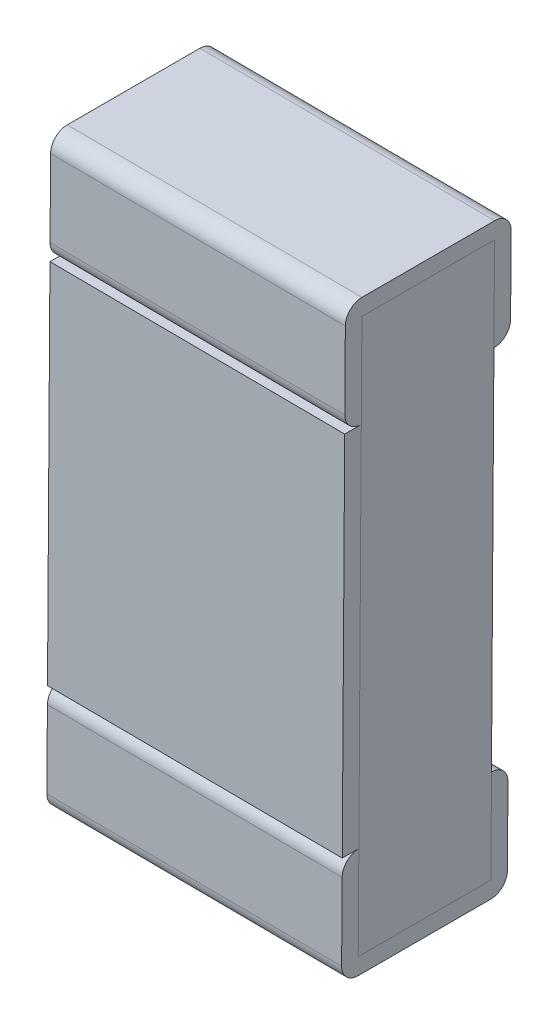
ISO-10303-21;
HEADER;
FILE_DESCRIPTION(('STEP AP214'),'2;1');
FILE_NAME('part.step','',(''),(''),'','','');
FILE_SCHEMA(('AUTOMOTIVE_DESIGN { 1 0 10303 214 1 1 1 1 }'));
ENDSEC;
DATA;
#1=APPLICATION_CONTEXT('core data for automotive mechanical design processes');
#2=APPLICATION_PROTOCOL_DEFINITION('international standard','automotive_design',2000,#1);
#3=PRODUCT_CONTEXT('',#1,'mechanical');
#4=PRODUCT('Part','Part','',(#3));
#5=PRODUCT_RELATED_PRODUCT_CATEGORY('part','',(#4));
#6=PRODUCT_DEFINITION_FORMATION('','',#4);
#7=PRODUCT_DEFINITION_CONTEXT('part definition',#1,'design');
#8=PRODUCT_DEFINITION('design','',#6,#7);
#9=PRODUCT_DEFINITION_SHAPE('','',#8);
#10=(LENGTH_UNIT() NAMED_UNIT(*) SI_UNIT(.MILLI.,.METRE.));
#11=(NAMED_UNIT(*) PLANE_ANGLE_UNIT() SI_UNIT($,.RADIAN.));
#12=(NAMED_UNIT(*) SI_UNIT($,.STERADIAN.) SOLID_ANGLE_UNIT());
#13=UNCERTAINTY_MEASURE_WITH_UNIT(LENGTH_MEASURE(1.E-05),#10,'distance_accuracy_value','');
#14=(GEOMETRIC_REPRESENTATION_CONTEXT(3) GLOBAL_UNCERTAINTY_ASSIGNED_CONTEXT((#13)) GLOBAL_UNIT_ASSIGNED_CONTEXT((#10,
#11,#12)) REPRESENTATION_CONTEXT('',''));
#15=CARTESIAN_POINT('',(0.,0.,0.));
#16=DIRECTION('',(0.,0.,1.));
#17=DIRECTION('',(1.,0.,0.));
#18=AXIS2_PLACEMENT_3D('',#15,#16,#17);
#19=CARTESIAN_POINT('',(216.723566327563,106.259604065582,142.661582908599));
#20=DIRECTION('',(0.,0.,1.));
#21=DIRECTION('',(1.,0.,0.));
#22=AXIS2_PLACEMENT_3D('',#19,#20,#21);
#23=PLANE('',#22);
#24=DIRECTION('',(0.999978016708569,-0.00663069374923689,0.));
#25=VECTOR('',#24,1.);
#26=CARTESIAN_POINT('',(216.723566327563,106.259604065582,142.661582908599));
#27=LINE('',#26,#25);
#28=CARTESIAN_POINT('',(216.723566327563,106.259604065582,142.661582908599));
#29=VERTEX_POINT('',#28);
#30=CARTESIAN_POINT('',(217.52354874093,106.254299510583,142.661582908599));
#31=VERTEX_POINT('',#30);
#32=EDGE_CURVE('E67',#29,#31,#27,.T.);
#33=ORIENTED_EDGE('',*,*,#32,.F.);
#34=DIRECTION('',(-0.00663069374923689,-0.999978016708569,0.));
#35=VECTOR('',#34,1.);
#36=CARTESIAN_POINT('',(216.723566327563,106.259604065582,142.661582908599));
#37=LINE('',#36,#35);
#38=CARTESIAN_POINT('',(216.716935633814,105.259626048874,142.661582908599));
#39=VERTEX_POINT('',#38);
#40=EDGE_CURVE('E11',#29,#39,#37,.T.);
#41=ORIENTED_EDGE('',*,*,#40,.T.);
#42=DIRECTION('',(0.999978016708569,-0.00663069374923689,0.));
#43=VECTOR('',#42,1.);
#44=CARTESIAN_POINT('',(216.716935633814,105.259626048874,142.661582908599));
#45=LINE('',#44,#43);
#46=CARTESIAN_POINT('',(217.516918047181,105.254321493874,142.661582908599));
#47=VERTEX_POINT('',#46);
#48=EDGE_CURVE('E55',#39,#47,#45,.T.);
#49=ORIENTED_EDGE('',*,*,#48,.T.);
#50=DIRECTION('',(-0.00663069374923689,-0.999978016708569,0.));
#51=VECTOR('',#50,1.);
#52=CARTESIAN_POINT('',(217.52354874093,106.254299510583,142.661582908599));
#53=LINE('',#52,#51);
#54=EDGE_CURVE('E313',#31,#47,#53,.T.);
#55=ORIENTED_EDGE('',*,*,#54,.F.);
#56=EDGE_LOOP('',(#33,#41,#49,#55));
#57=FACE_BOUND('',#56,.T.);
#58=ADVANCED_FACE('F44',(#57),#23,.T.);
#59=CARTESIAN_POINT('',(216.716935633814,105.259626048874,142.616582908599));
#60=DIRECTION('',(-0.00663069374923689,-0.99997801670857,0.));
#61=DIRECTION('',(-0.99997801670857,0.00663069374923689,0.));
#62=AXIS2_PLACEMENT_3D('',#59,#60,#61);
#63=PLANE('',#62);
#64=DIRECTION('',(0.,0.,1.));
#65=VECTOR('',#64,1.);
#66=CARTESIAN_POINT('',(216.716935633814,105.259626048874,142.616582908599));
#67=LINE('',#66,#65);
#68=CARTESIAN_POINT('',(216.716935633814,105.259626048874,142.616582908599));
#69=VERTEX_POINT('',#68);
#70=EDGE_CURVE('E326',#69,#39,#67,.T.);
#71=ORIENTED_EDGE('',*,*,#70,.F.);
#72=DIRECTION('',(0.999978016708569,-0.00663069374923689,0.));
#73=VECTOR('',#72,1.);
#74=CARTESIAN_POINT('',(216.716935633814,105.259626048874,142.616582908599));
#75=LINE('',#74,#73);
#76=CARTESIAN_POINT('',(217.516918047181,105.254321493874,142.616582908599));
#77=VERTEX_POINT('',#76);
#78=EDGE_CURVE('E302',#69,#77,#75,.T.);
#79=ORIENTED_EDGE('',*,*,#78,.T.);
#80=DIRECTION('',(0.,0.,1.));
#81=VECTOR('',#80,1.);
#82=CARTESIAN_POINT('',(217.516918047181,105.254321493874,142.616582908599));
#83=LINE('',#82,#81);
#84=EDGE_CURVE('E298',#77,#47,#83,.T.);
#85=ORIENTED_EDGE('',*,*,#84,.T.);
#86=ORIENTED_EDGE('',*,*,#48,.F.);
#87=EDGE_LOOP('',(#71,#79,#85,#86));
#88=FACE_BOUND('',#87,.T.);
#89=ADVANCED_FACE('F523',(#88),#63,.T.);
#90=CARTESIAN_POINT('',(216.716637252595,105.214627038122,142.616582908599));
#91=DIRECTION('',(0.999978016708571,-0.00663069374900344,0.));
#92=DIRECTION('',(0.00663069374900344,0.999978016708571,0.));
#93=AXIS2_PLACEMENT_3D('',#90,#91,#92);
#94=CYLINDRICAL_SURFACE('',#93,0.0450000000000037);
#95=CARTESIAN_POINT('',(216.716637252595,105.214627038122,142.616582908599));
#96=DIRECTION('',(0.99997801670857,-0.00663069374923689,0.));
#97=DIRECTION('',(0.,0.,1.));
#98=AXIS2_PLACEMENT_3D('',#95,#96,#97);
#99=CIRCLE('',#98,0.0449999999999895);
#100=CARTESIAN_POINT('',(216.716637252595,105.214627038122,142.661582908599));
#101=VERTEX_POINT('',#100);
#102=EDGE_CURVE('E303',#69,#101,#99,.T.);
#103=ORIENTED_EDGE('',*,*,#102,.T.);
#104=DIRECTION('',(0.999978016708569,-0.00663069374923689,0.));
#105=VECTOR('',#104,1.);
#106=CARTESIAN_POINT('',(216.716637252595,105.214627038122,142.661582908599));
#107=LINE('',#106,#105);
#108=CARTESIAN_POINT('',(217.516619665962,105.209322483122,142.661582908599));
#109=VERTEX_POINT('',#108);
#110=EDGE_CURVE('E345',#101,#109,#107,.T.);
#111=ORIENTED_EDGE('',*,*,#110,.T.);
#112=CARTESIAN_POINT('',(217.516619665962,105.209322483122,142.616582908599));
#113=DIRECTION('',(0.99997801670857,-0.00663069374923689,0.));
#114=DIRECTION('',(0.,0.,1.));
#115=AXIS2_PLACEMENT_3D('',#112,#113,#114);
#116=CIRCLE('',#115,0.0449999999999895);
#117=EDGE_CURVE('E387',#77,#109,#116,.T.);
#118=ORIENTED_EDGE('',*,*,#117,.F.);
#119=ORIENTED_EDGE('',*,*,#78,.F.);
#120=EDGE_LOOP('',(#103,#111,#118,#119));
#121=FACE_BOUND('',#120,.T.);
#122=ADVANCED_FACE('F528',(#121),#94,.T.);
#123=CARTESIAN_POINT('',(216.716935633814,105.259626048874,142.661582908599));
#124=DIRECTION('',(0.,0.,1.));
#125=DIRECTION('',(1.,0.,0.));
#126=AXIS2_PLACEMENT_3D('',#123,#124,#125);
#127=PLANE('',#126);
#128=DIRECTION('',(-0.00663069374923689,-0.999978016708569,0.));
#129=VECTOR('',#128,1.);
#130=CARTESIAN_POINT('',(217.516918047181,105.254321493874,142.661582908599));
#131=LINE('',#130,#129);
#132=CARTESIAN_POINT('',(217.515227220275,104.999327099614,142.661582908599));
#133=VERTEX_POINT('',#132);
#134=EDGE_CURVE('E207',#109,#133,#131,.T.);
#135=ORIENTED_EDGE('',*,*,#134,.F.);
#136=ORIENTED_EDGE('',*,*,#110,.F.);
#137=DIRECTION('',(-0.00663069374923689,-0.999978016708569,0.));
#138=VECTOR('',#137,1.);
#139=CARTESIAN_POINT('',(216.716935633814,105.259626048874,142.661582908599));
#140=LINE('',#139,#138);
#141=CARTESIAN_POINT('',(216.715244806908,105.004631654613,142.661582908599));
#142=VERTEX_POINT('',#141);
#143=EDGE_CURVE('E355',#101,#142,#140,.T.);
#144=ORIENTED_EDGE('',*,*,#143,.T.);
#145=DIRECTION('',(0.999978016708569,-0.00663069374923689,0.));
#146=VECTOR('',#145,1.);
#147=CARTESIAN_POINT('',(216.715244806908,105.004631654613,142.661582908599));
#148=LINE('',#147,#146);
#149=EDGE_CURVE('E405',#142,#133,#148,.T.);
#150=ORIENTED_EDGE('',*,*,#149,.T.);
#151=EDGE_LOOP('',(#135,#136,#144,#150));
#152=FACE_BOUND('',#151,.T.);
#153=ADVANCED_FACE('F542',(#152),#127,.T.);
#154=CARTESIAN_POINT('',(216.715244806908,105.004631654613,142.616582908599));
#155=DIRECTION('',(0.999978016708571,-0.00663069374900344,0.));
#156=DIRECTION('',(-0.00663069374900344,-0.999978016708571,0.));
#157=AXIS2_PLACEMENT_3D('',#154,#155,#156);
#158=CYLINDRICAL_SURFACE('',#157,0.0450000000000037);
#159=DIRECTION('',(0.999978016708569,-0.00663069374923689,0.));
#160=VECTOR('',#159,1.);
#161=CARTESIAN_POINT('',(216.714946425689,104.959632643861,142.616582908599));
#162=LINE('',#161,#160);
#163=CARTESIAN_POINT('',(216.714946425689,104.959632643861,142.616582908599));
#164=VERTEX_POINT('',#163);
#165=CARTESIAN_POINT('',(217.514928839056,104.954328088862,142.616582908599));
#166=VERTEX_POINT('',#165);
#167=EDGE_CURVE('E358',#164,#166,#162,.T.);
#168=ORIENTED_EDGE('',*,*,#167,.T.);
#169=CARTESIAN_POINT('',(217.515227220275,104.999327099614,142.616582908599));
#170=DIRECTION('',(-0.99997801670857,0.00663069374923689,0.));
#171=DIRECTION('',(0.,0.,1.));
#172=AXIS2_PLACEMENT_3D('',#169,#170,#171);
#173=CIRCLE('',#172,0.0449999999999895);
#174=EDGE_CURVE('E200',#166,#133,#173,.T.);
#175=ORIENTED_EDGE('',*,*,#174,.T.);
#176=ORIENTED_EDGE('',*,*,#149,.F.);
#177=CARTESIAN_POINT('',(216.715244806908,105.004631654613,142.616582908599));
#178=DIRECTION('',(-0.99997801670857,0.00663069374923689,0.));
#179=DIRECTION('',(0.,0.,1.));
#180=AXIS2_PLACEMENT_3D('',#177,#178,#179);
#181=CIRCLE('',#180,0.0449999999999895);
#182=EDGE_CURVE('E192',#164,#142,#181,.T.);
#183=ORIENTED_EDGE('',*,*,#182,.F.);
#184=EDGE_LOOP('',(#168,#175,#176,#183));
#185=FACE_BOUND('',#184,.T.);
#186=ADVANCED_FACE('F539',(#185),#158,.T.);
#187=CARTESIAN_POINT('',(216.714946425689,104.959632643861,142.211582908599));
#188=DIRECTION('',(-0.00663069374923689,-0.99997801670857,0.));
#189=DIRECTION('',(-0.99997801670857,0.00663069374923689,0.));
#190=AXIS2_PLACEMENT_3D('',#187,#188,#189);
#191=PLANE('',#190);
#192=DIRECTION('',(0.,0.,1.));
#193=VECTOR('',#192,1.);
#194=CARTESIAN_POINT('',(216.714946425689,104.959632643861,142.211582908599));
#195=LINE('',#194,#193);
#196=CARTESIAN_POINT('',(216.714946425689,104.959632643861,142.256582908599));
#197=VERTEX_POINT('',#196);
#198=EDGE_CURVE('E471',#197,#164,#195,.T.);
#199=ORIENTED_EDGE('',*,*,#198,.F.);
#200=DIRECTION('',(0.999978016708569,-0.00663069374923689,0.));
#201=VECTOR('',#200,1.);
#202=CARTESIAN_POINT('',(216.714946425689,104.959632643861,142.256582908599));
#203=LINE('',#202,#201);
#204=CARTESIAN_POINT('',(217.514928839056,104.954328088862,142.256582908599));
#205=VERTEX_POINT('',#204);
#206=EDGE_CURVE('E318',#197,#205,#203,.T.);
#207=ORIENTED_EDGE('',*,*,#206,.T.);
#208=DIRECTION('',(0.,0.,1.));
#209=VECTOR('',#208,1.);
#210=CARTESIAN_POINT('',(217.514928839056,104.954328088862,142.211582908599));
#211=LINE('',#210,#209);
#212=EDGE_CURVE('E314',#205,#166,#211,.T.);
#213=ORIENTED_EDGE('',*,*,#212,.T.);
#214=ORIENTED_EDGE('',*,*,#167,.F.);
#215=EDGE_LOOP('',(#199,#207,#213,#214));
#216=FACE_BOUND('',#215,.T.);
#217=ADVANCED_FACE('F532',(#216),#191,.T.);
#218=CARTESIAN_POINT('',(216.715244806908,105.004631654613,142.256582908599));
#219=DIRECTION('',(0.999978016708571,-0.00663069374900344,0.));
#220=DIRECTION('',(-0.00663069374900344,-0.999978016708571,0.));
#221=AXIS2_PLACEMENT_3D('',#218,#219,#220);
#222=CYLINDRICAL_SURFACE('',#221,0.0450000000000037);
#223=CARTESIAN_POINT('',(216.715244806908,105.004631654613,142.256582908599));
#224=DIRECTION('',(0.99997801670857,-0.00663069374923689,0.));
#225=DIRECTION('',(0.,0.,1.));
#226=AXIS2_PLACEMENT_3D('',#223,#224,#225);
#227=CIRCLE('',#226,0.0449999999999895);
#228=CARTESIAN_POINT('',(216.715244806908,105.004631654613,142.211582908599));
#229=VERTEX_POINT('',#228);
#230=EDGE_CURVE('E319',#197,#229,#227,.T.);
#231=ORIENTED_EDGE('',*,*,#230,.T.);
#232=DIRECTION('',(0.999978016708569,-0.00663069374923689,0.));
#233=VECTOR('',#232,1.);
#234=CARTESIAN_POINT('',(216.715244806908,105.004631654613,142.211582908599));
#235=LINE('',#234,#233);
#236=CARTESIAN_POINT('',(217.515227220275,104.999327099614,142.211582908599));
#237=VERTEX_POINT('',#236);
#238=EDGE_CURVE('E409',#229,#237,#235,.T.);
#239=ORIENTED_EDGE('',*,*,#238,.T.);
#240=CARTESIAN_POINT('',(217.515227220275,104.999327099614,142.256582908599));
#241=DIRECTION('',(0.99997801670857,-0.00663069374923689,0.));
#242=DIRECTION('',(0.,0.,1.));
#243=AXIS2_PLACEMENT_3D('',#240,#241,#242);
#244=CIRCLE('',#243,0.0449999999999895);
#245=EDGE_CURVE('E346',#205,#237,#244,.T.);
#246=ORIENTED_EDGE('',*,*,#245,.F.);
#247=ORIENTED_EDGE('',*,*,#206,.F.);
#248=EDGE_LOOP('',(#231,#239,#246,#247));
#249=FACE_BOUND('',#248,.T.);
#250=ADVANCED_FACE('F676',(#249),#222,.T.);
#251=CARTESIAN_POINT('',(216.716935633814,105.259626048874,142.211582908599));
#252=DIRECTION('',(0.,0.,1.));
#253=DIRECTION('',(1.,0.,0.));
#254=AXIS2_PLACEMENT_3D('',#251,#252,#253);
#255=PLANE('',#254);
#256=ORIENTED_EDGE('',*,*,#238,.F.);
#257=DIRECTION('',(-0.00663069374923689,-0.999978016708569,0.));
#258=VECTOR('',#257,1.);
#259=CARTESIAN_POINT('',(216.716935633814,105.259626048874,142.211582908599));
#260=LINE('',#259,#258);
#261=CARTESIAN_POINT('',(216.716637252595,105.214627038122,142.211582908599));
#262=VERTEX_POINT('',#261);
#263=EDGE_CURVE('E416',#262,#229,#260,.T.);
#264=ORIENTED_EDGE('',*,*,#263,.F.);
#265=DIRECTION('',(0.999978016708569,-0.00663069374923689,0.));
#266=VECTOR('',#265,1.);
#267=CARTESIAN_POINT('',(216.716637252595,105.214627038122,142.211582908599));
#268=LINE('',#267,#266);
#269=CARTESIAN_POINT('',(217.516619665962,105.209322483122,142.211582908599));
#270=VERTEX_POINT('',#269);
#271=EDGE_CURVE('E363',#262,#270,#268,.T.);
#272=ORIENTED_EDGE('',*,*,#271,.T.);
#273=DIRECTION('',(-0.00663069374923689,-0.999978016708569,0.));
#274=VECTOR('',#273,1.);
#275=CARTESIAN_POINT('',(217.516918047181,105.254321493874,142.211582908599));
#276=LINE('',#275,#274);
#277=EDGE_CURVE('E359',#270,#237,#276,.T.);
#278=ORIENTED_EDGE('',*,*,#277,.T.);
#279=EDGE_LOOP('',(#256,#264,#272,#278));
#280=FACE_BOUND('',#279,.T.);
#281=ADVANCED_FACE('F699',(#280),#255,.F.);
#282=CARTESIAN_POINT('',(216.716637252595,105.214627038122,142.256582908599));
#283=DIRECTION('',(0.999978016708571,-0.00663069374900344,0.));
#284=DIRECTION('',(0.00663069374900344,0.999978016708571,0.));
#285=AXIS2_PLACEMENT_3D('',#282,#283,#284);
#286=CYLINDRICAL_SURFACE('',#285,0.0450000000000037);
#287=DIRECTION('',(0.999978016708569,-0.00663069374923689,0.));
#288=VECTOR('',#287,1.);
#289=CARTESIAN_POINT('',(216.716935633814,105.259626048874,142.256582908599));
#290=LINE('',#289,#288);
#291=CARTESIAN_POINT('',(216.716935633814,105.259626048874,142.256582908599));
#292=VERTEX_POINT('',#291);
#293=CARTESIAN_POINT('',(217.516918047181,105.254321493874,142.256582908599));
#294=VERTEX_POINT('',#293);
#295=EDGE_CURVE('E364',#292,#294,#290,.T.);
#296=ORIENTED_EDGE('',*,*,#295,.T.);
#297=CARTESIAN_POINT('',(217.516619665962,105.209322483122,142.256582908599));
#298=DIRECTION('',(-0.99997801670857,0.00663069374923689,0.));
#299=DIRECTION('',(0.,0.,1.));
#300=AXIS2_PLACEMENT_3D('',#297,#298,#299);
#301=CIRCLE('',#300,0.0449999999999895);
#302=EDGE_CURVE('E388',#294,#270,#301,.T.);
#303=ORIENTED_EDGE('',*,*,#302,.T.);
#304=ORIENTED_EDGE('',*,*,#271,.F.);
#305=CARTESIAN_POINT('',(216.716637252595,105.214627038122,142.256582908599));
#306=DIRECTION('',(-0.99997801670857,0.00663069374923689,0.));
#307=DIRECTION('',(0.,0.,1.));
#308=AXIS2_PLACEMENT_3D('',#305,#306,#307);
#309=CIRCLE('',#308,0.0449999999999895);
#310=EDGE_CURVE('E396',#292,#262,#309,.T.);
#311=ORIENTED_EDGE('',*,*,#310,.F.);
#312=EDGE_LOOP('',(#296,#303,#304,#311));
#313=FACE_BOUND('',#312,.T.);
#314=ADVANCED_FACE('F537',(#313),#286,.T.);
#315=CARTESIAN_POINT('',(217.52354874093,106.254299510583,142.616582908599));
#316=DIRECTION('',(0.99997801670857,-0.00663069374923689,0.));
#317=DIRECTION('',(0.,0.,-1.));
#318=AXIS2_PLACEMENT_3D('',#315,#316,#317);
#319=PLANE('',#318);
#320=DIRECTION('',(-0.00663069374923689,-0.999978016708569,0.));
#321=VECTOR('',#320,1.);
#322=CARTESIAN_POINT('',(217.52354874093,106.254299510583,142.616582908599));
#323=LINE('',#322,#321);
#324=CARTESIAN_POINT('',(217.52354874093,106.254299510583,142.616582908599));
#325=VERTEX_POINT('',#324);
#326=EDGE_CURVE('E332',#325,#77,#323,.T.);
#327=ORIENTED_EDGE('',*,*,#326,.F.);
#328=DIRECTION('',(0.,0.,1.));
#329=VECTOR('',#328,1.);
#330=CARTESIAN_POINT('',(217.52354874093,106.254299510583,142.616582908599));
#331=LINE('',#330,#329);
#332=EDGE_CURVE('E392',#325,#31,#331,.T.);
#333=ORIENTED_EDGE('',*,*,#332,.T.);
#334=ORIENTED_EDGE('',*,*,#54,.T.);
#335=ORIENTED_EDGE('',*,*,#84,.F.);
#336=EDGE_LOOP('',(#327,#333,#334,#335));
#337=FACE_BOUND('',#336,.T.);
#338=ADVANCED_FACE('F533',(#337),#319,.T.);
#339=CARTESIAN_POINT('',(217.516918047181,105.254321493874,142.211582908599));
#340=DIRECTION('',(0.99997801670857,-0.00663069374923689,0.));
#341=DIRECTION('',(0.,0.,-1.));
#342=AXIS2_PLACEMENT_3D('',#339,#340,#341);
#343=PLANE('',#342);
#344=ORIENTED_EDGE('',*,*,#277,.F.);
#345=ORIENTED_EDGE('',*,*,#302,.F.);
#346=DIRECTION('',(-0.00663069374923689,-0.999978016708569,0.));
#347=VECTOR('',#346,1.);
#348=CARTESIAN_POINT('',(217.525239567836,106.509293904844,142.256582908599));
#349=LINE('',#348,#347);
#350=CARTESIAN_POINT('',(217.515227220275,104.999327099614,142.256582908599));
#351=VERTEX_POINT('',#350);
#352=EDGE_CURVE('E310',#294,#351,#349,.T.);
#353=ORIENTED_EDGE('',*,*,#352,.T.);
#354=DIRECTION('',(0.,0.,1.));
#355=VECTOR('',#354,1.);
#356=CARTESIAN_POINT('',(217.515227220275,104.999327099614,142.256582908599));
#357=LINE('',#356,#355);
#358=CARTESIAN_POINT('',(217.515227220275,104.999327099614,142.616582908599));
#359=VERTEX_POINT('',#358);
#360=EDGE_CURVE('E48',#351,#359,#357,.T.);
#361=ORIENTED_EDGE('',*,*,#360,.T.);
#362=DIRECTION('',(-0.00663069374923689,-0.999978016708569,0.));
#363=VECTOR('',#362,1.);
#364=CARTESIAN_POINT('',(217.525239567836,106.509293904844,142.616582908599));
#365=LINE('',#364,#363);
#366=EDGE_CURVE('E336',#77,#359,#365,.T.);
#367=ORIENTED_EDGE('',*,*,#366,.F.);
#368=ORIENTED_EDGE('',*,*,#117,.T.);
#369=ORIENTED_EDGE('',*,*,#134,.T.);
#370=ORIENTED_EDGE('',*,*,#174,.F.);
#371=ORIENTED_EDGE('',*,*,#212,.F.);
#372=ORIENTED_EDGE('',*,*,#245,.T.);
#373=EDGE_LOOP('',(#344,#345,#353,#361,#367,#368,#369,#370,#371,#372));
#374=FACE_BOUND('',#373,.T.);
#375=ADVANCED_FACE('F536',(#374),#343,.T.);
#376=CARTESIAN_POINT('',(216.723566327563,106.259604065582,142.616582908599));
#377=DIRECTION('',(-0.00663069374923689,-0.99997801670857,0.));
#378=DIRECTION('',(-0.99997801670857,0.00663069374923689,0.));
#379=AXIS2_PLACEMENT_3D('',#376,#377,#378);
#380=PLANE('',#379);
#381=ORIENTED_EDGE('',*,*,#32,.T.);
#382=ORIENTED_EDGE('',*,*,#332,.F.);
#383=DIRECTION('',(0.999978016708569,-0.00663069374923689,0.));
#384=VECTOR('',#383,1.);
#385=CARTESIAN_POINT('',(216.723566327563,106.259604065582,142.616582908599));
#386=LINE('',#385,#384);
#387=CARTESIAN_POINT('',(216.723566327563,106.259604065582,142.616582908599));
#388=VERTEX_POINT('',#387);
#389=EDGE_CURVE('E369',#388,#325,#386,.T.);
#390=ORIENTED_EDGE('',*,*,#389,.F.);
#391=DIRECTION('',(0.,0.,1.));
#392=VECTOR('',#391,1.);
#393=CARTESIAN_POINT('',(216.723566327563,106.259604065582,142.616582908599));
#394=LINE('',#393,#392);
#395=EDGE_CURVE('E330',#388,#29,#394,.T.);
#396=ORIENTED_EDGE('',*,*,#395,.T.);
#397=EDGE_LOOP('',(#381,#382,#390,#396));
#398=FACE_BOUND('',#397,.T.);
#399=ADVANCED_FACE('F551',(#398),#380,.F.);
#400=CARTESIAN_POINT('',(216.723566327563,106.259604065582,142.616582908599));
#401=DIRECTION('',(0.99997801670857,-0.00663069374923689,0.));
#402=DIRECTION('',(0.,0.,-1.));
#403=AXIS2_PLACEMENT_3D('',#400,#401,#402);
#404=PLANE('',#403);
#405=ORIENTED_EDGE('',*,*,#70,.T.);
#406=ORIENTED_EDGE('',*,*,#40,.F.);
#407=ORIENTED_EDGE('',*,*,#395,.F.);
#408=DIRECTION('',(-0.00663069374923689,-0.999978016708569,0.));
#409=VECTOR('',#408,1.);
#410=CARTESIAN_POINT('',(216.723566327563,106.259604065582,142.616582908599));
#411=LINE('',#410,#409);
#412=EDGE_CURVE('E331',#388,#69,#411,.T.);
#413=ORIENTED_EDGE('',*,*,#412,.T.);
#414=EDGE_LOOP('',(#405,#406,#407,#413));
#415=FACE_BOUND('',#414,.T.);
#416=ADVANCED_FACE('F553',(#415),#404,.F.);
#417=CARTESIAN_POINT('',(216.716935633814,105.259626048874,142.211582908599));
#418=DIRECTION('',(0.99997801670857,-0.00663069374923689,0.));
#419=DIRECTION('',(0.,0.,-1.));
#420=AXIS2_PLACEMENT_3D('',#417,#418,#419);
#421=PLANE('',#420);
#422=ORIENTED_EDGE('',*,*,#230,.F.);
#423=ORIENTED_EDGE('',*,*,#198,.T.);
#424=ORIENTED_EDGE('',*,*,#182,.T.);
#425=ORIENTED_EDGE('',*,*,#143,.F.);
#426=ORIENTED_EDGE('',*,*,#102,.F.);
#427=DIRECTION('',(-0.00663069374923689,-0.999978016708569,0.));
#428=VECTOR('',#427,1.);
#429=CARTESIAN_POINT('',(216.725257154469,106.514598459843,142.616582908599));
#430=LINE('',#429,#428);
#431=CARTESIAN_POINT('',(216.715244806908,105.004631654613,142.616582908599));
#432=VERTEX_POINT('',#431);
#433=EDGE_CURVE('E393',#69,#432,#430,.T.);
#434=ORIENTED_EDGE('',*,*,#433,.T.);
#435=DIRECTION('',(0.,0.,1.));
#436=VECTOR('',#435,1.);
#437=CARTESIAN_POINT('',(216.715244806908,105.004631654613,142.256582908599));
#438=LINE('',#437,#436);
#439=CARTESIAN_POINT('',(216.715244806908,105.004631654613,142.256582908599));
#440=VERTEX_POINT('',#439);
#441=EDGE_CURVE('E446',#440,#432,#438,.T.);
#442=ORIENTED_EDGE('',*,*,#441,.F.);
#443=DIRECTION('',(-0.00663069374923689,-0.999978016708569,0.));
#444=VECTOR('',#443,1.);
#445=CARTESIAN_POINT('',(216.725257154469,106.514598459843,142.256582908599));
#446=LINE('',#445,#444);
#447=EDGE_CURVE('E297',#292,#440,#446,.T.);
#448=ORIENTED_EDGE('',*,*,#447,.F.);
#449=ORIENTED_EDGE('',*,*,#310,.T.);
#450=ORIENTED_EDGE('',*,*,#263,.T.);
#451=EDGE_LOOP('',(#422,#423,#424,#425,#426,#434,#442,#448,#449,#450));
#452=FACE_BOUND('',#451,.T.);
#453=ADVANCED_FACE('F555',(#452),#421,.F.);
#454=CARTESIAN_POINT('',(216.725257154469,106.514598459843,142.256582908599));
#455=DIRECTION('',(0.,0.,1.));
#456=DIRECTION('',(1.,0.,0.));
#457=AXIS2_PLACEMENT_3D('',#454,#455,#456);
#458=PLANE('',#457);
#459=DIRECTION('',(-0.00663069374923689,-0.999978016708569,0.));
#460=VECTOR('',#459,1.);
#461=CARTESIAN_POINT('',(217.525239567836,106.509293904844,142.256582908599));
#462=LINE('',#461,#460);
#463=CARTESIAN_POINT('',(217.52354874093,106.254299510583,142.256582908599));
#464=VERTEX_POINT('',#463);
#465=EDGE_CURVE('E324',#464,#294,#462,.T.);
#466=ORIENTED_EDGE('',*,*,#465,.T.);
#467=ORIENTED_EDGE('',*,*,#295,.F.);
#468=DIRECTION('',(-0.00663069374923689,-0.999978016708569,0.));
#469=VECTOR('',#468,1.);
#470=CARTESIAN_POINT('',(216.725257154469,106.514598459843,142.256582908599));
#471=LINE('',#470,#469);
#472=CARTESIAN_POINT('',(216.723566327563,106.259604065582,142.256582908599));
#473=VERTEX_POINT('',#472);
#474=EDGE_CURVE('E292',#473,#292,#471,.T.);
#475=ORIENTED_EDGE('',*,*,#474,.F.);
#476=DIRECTION('',(0.999978016708569,-0.00663069374923689,0.));
#477=VECTOR('',#476,1.);
#478=CARTESIAN_POINT('',(216.723566327563,106.259604065582,142.256582908599));
#479=LINE('',#478,#477);
#480=EDGE_CURVE('E320',#473,#464,#479,.T.);
#481=ORIENTED_EDGE('',*,*,#480,.T.);
#482=EDGE_LOOP('',(#466,#467,#475,#481));
#483=FACE_BOUND('',#482,.T.);
#484=ADVANCED_FACE('F546',(#483),#458,.F.);
#485=CARTESIAN_POINT('',(217.525239567836,106.509293904844,142.256582908599));
#486=DIRECTION('',(0.99997801670857,-0.00663069374923689,0.));
#487=DIRECTION('',(0.,0.,-1.));
#488=AXIS2_PLACEMENT_3D('',#485,#486,#487);
#489=PLANE('',#488);
#490=DIRECTION('',(-0.00663069374923689,-0.999978016708569,0.));
#491=VECTOR('',#490,1.);
#492=CARTESIAN_POINT('',(217.525239567836,106.509293904844,142.256582908599));
#493=LINE('',#492,#491);
#494=CARTESIAN_POINT('',(217.525239567836,106.509293904844,142.256582908599));
#495=VERTEX_POINT('',#494);
#496=EDGE_CURVE('E289',#495,#464,#493,.T.);
#497=ORIENTED_EDGE('',*,*,#496,.F.);
#498=DIRECTION('',(0.,0.,1.));
#499=VECTOR('',#498,1.);
#500=CARTESIAN_POINT('',(217.525239567836,106.509293904844,142.256582908599));
#501=LINE('',#500,#499);
#502=CARTESIAN_POINT('',(217.525239567836,106.509293904844,142.616582908599));
#503=VERTEX_POINT('',#502);
#504=EDGE_CURVE('E325',#495,#503,#501,.T.);
#505=ORIENTED_EDGE('',*,*,#504,.T.);
#506=DIRECTION('',(-0.00663069374923689,-0.999978016708569,0.));
#507=VECTOR('',#506,1.);
#508=CARTESIAN_POINT('',(217.525239567836,106.509293904844,142.616582908599));
#509=LINE('',#508,#507);
#510=EDGE_CURVE('E335',#503,#325,#509,.T.);
#511=ORIENTED_EDGE('',*,*,#510,.T.);
#512=ORIENTED_EDGE('',*,*,#326,.T.);
#513=ORIENTED_EDGE('',*,*,#366,.T.);
#514=ORIENTED_EDGE('',*,*,#360,.F.);
#515=ORIENTED_EDGE('',*,*,#352,.F.);
#516=ORIENTED_EDGE('',*,*,#465,.F.);
#517=EDGE_LOOP('',(#497,#505,#511,#512,#513,#514,#515,#516));
#518=FACE_BOUND('',#517,.T.);
#519=ADVANCED_FACE('F543',(#518),#489,.T.);
#520=CARTESIAN_POINT('',(216.723864708781,106.304603076334,142.616582908599));
#521=DIRECTION('',(0.999978016708571,-0.00663069374900344,0.));
#522=DIRECTION('',(-0.00663069374900344,-0.999978016708571,0.));
#523=AXIS2_PLACEMENT_3D('',#520,#521,#522);
#524=CYLINDRICAL_SURFACE('',#523,0.0450000000000037);
#525=ORIENTED_EDGE('',*,*,#389,.T.);
#526=CARTESIAN_POINT('',(217.523847122149,106.299298521335,142.616582908599));
#527=DIRECTION('',(-0.99997801670857,0.00663069374923689,0.));
#528=DIRECTION('',(0.,0.,1.));
#529=AXIS2_PLACEMENT_3D('',#526,#527,#528);
#530=CIRCLE('',#529,0.0449999999999895);
#531=CARTESIAN_POINT('',(217.523847122149,106.299298521335,142.661582908599));
#532=VERTEX_POINT('',#531);
#533=EDGE_CURVE('E365',#325,#532,#530,.T.);
#534=ORIENTED_EDGE('',*,*,#533,.T.);
#535=DIRECTION('',(0.999978016708569,-0.00663069374923689,0.));
#536=VECTOR('',#535,1.);
#537=CARTESIAN_POINT('',(216.723864708781,106.304603076334,142.661582908599));
#538=LINE('',#537,#536);
#539=CARTESIAN_POINT('',(216.723864708781,106.304603076334,142.661582908599));
#540=VERTEX_POINT('',#539);
#541=EDGE_CURVE('E296',#540,#532,#538,.T.);
#542=ORIENTED_EDGE('',*,*,#541,.F.);
#543=CARTESIAN_POINT('',(216.723864708781,106.304603076334,142.616582908599));
#544=DIRECTION('',(-0.99997801670857,0.00663069374923689,0.));
#545=DIRECTION('',(0.,0.,1.));
#546=AXIS2_PLACEMENT_3D('',#543,#544,#545);
#547=CIRCLE('',#546,0.0449999999999895);
#548=EDGE_CURVE('E309',#388,#540,#547,.T.);
#549=ORIENTED_EDGE('',*,*,#548,.F.);
#550=EDGE_LOOP('',(#525,#534,#542,#549));
#551=FACE_BOUND('',#550,.T.);
#552=ADVANCED_FACE('F545',(#551),#524,.T.);
#553=CARTESIAN_POINT('',(216.725555535687,106.559597470595,142.661582908599));
#554=DIRECTION('',(0.,0.,1.));
#555=DIRECTION('',(1.,0.,0.));
#556=AXIS2_PLACEMENT_3D('',#553,#554,#555);
#557=PLANE('',#556);
#558=DIRECTION('',(-0.00663069374923689,-0.999978016708569,0.));
#559=VECTOR('',#558,1.);
#560=CARTESIAN_POINT('',(217.525537949054,106.554292915595,142.661582908599));
#561=LINE('',#560,#559);
#562=CARTESIAN_POINT('',(217.525239567836,106.509293904844,142.661582908599));
#563=VERTEX_POINT('',#562);
#564=EDGE_CURVE('E291',#563,#532,#561,.T.);
#565=ORIENTED_EDGE('',*,*,#564,.F.);
#566=DIRECTION('',(0.999978016708569,-0.00663069374923689,0.));
#567=VECTOR('',#566,1.);
#568=CARTESIAN_POINT('',(216.725257154469,106.514598459843,142.661582908599));
#569=LINE('',#568,#567);
#570=CARTESIAN_POINT('',(216.725257154469,106.514598459843,142.661582908599));
#571=VERTEX_POINT('',#570);
#572=EDGE_CURVE('E277',#571,#563,#569,.T.);
#573=ORIENTED_EDGE('',*,*,#572,.F.);
#574=DIRECTION('',(-0.00663069374923689,-0.999978016708569,0.));
#575=VECTOR('',#574,1.);
#576=CARTESIAN_POINT('',(216.725555535687,106.559597470595,142.661582908599));
#577=LINE('',#576,#575);
#578=EDGE_CURVE('E274',#571,#540,#577,.T.);
#579=ORIENTED_EDGE('',*,*,#578,.T.);
#580=ORIENTED_EDGE('',*,*,#541,.T.);
#581=EDGE_LOOP('',(#565,#573,#579,#580));
#582=FACE_BOUND('',#581,.T.);
#583=ADVANCED_FACE('F759',(#582),#557,.T.);
#584=CARTESIAN_POINT('',(216.725257154469,106.514598459843,142.256582908599));
#585=DIRECTION('',(0.99997801670857,-0.00663069374923689,0.));
#586=DIRECTION('',(0.,0.,-1.));
#587=AXIS2_PLACEMENT_3D('',#584,#585,#586);
#588=PLANE('',#587);
#589=ORIENTED_EDGE('',*,*,#474,.T.);
#590=ORIENTED_EDGE('',*,*,#447,.T.);
#591=ORIENTED_EDGE('',*,*,#441,.T.);
#592=ORIENTED_EDGE('',*,*,#433,.F.);
#593=ORIENTED_EDGE('',*,*,#412,.F.);
#594=DIRECTION('',(-0.00663069374923689,-0.999978016708569,0.));
#595=VECTOR('',#594,1.);
#596=CARTESIAN_POINT('',(216.725257154469,106.514598459843,142.616582908599));
#597=LINE('',#596,#595);
#598=CARTESIAN_POINT('',(216.725257154469,106.514598459843,142.616582908599));
#599=VERTEX_POINT('',#598);
#600=EDGE_CURVE('E375',#599,#388,#597,.T.);
#601=ORIENTED_EDGE('',*,*,#600,.F.);
#602=DIRECTION('',(0.,0.,1.));
#603=VECTOR('',#602,1.);
#604=CARTESIAN_POINT('',(216.725257154469,106.514598459843,142.256582908599));
#605=LINE('',#604,#603);
#606=CARTESIAN_POINT('',(216.725257154469,106.514598459843,142.256582908599));
#607=VERTEX_POINT('',#606);
#608=EDGE_CURVE('E384',#607,#599,#605,.T.);
#609=ORIENTED_EDGE('',*,*,#608,.F.);
#610=DIRECTION('',(-0.00663069374923689,-0.999978016708569,0.));
#611=VECTOR('',#610,1.);
#612=CARTESIAN_POINT('',(216.725257154469,106.514598459843,142.256582908599));
#613=LINE('',#612,#611);
#614=EDGE_CURVE('E475',#607,#473,#613,.T.);
#615=ORIENTED_EDGE('',*,*,#614,.T.);
#616=EDGE_LOOP('',(#589,#590,#591,#592,#593,#601,#609,#615));
#617=FACE_BOUND('',#616,.T.);
#618=ADVANCED_FACE('F579',(#617),#588,.F.);
#619=CARTESIAN_POINT('',(216.723864708781,106.304603076334,142.256582908599));
#620=DIRECTION('',(0.999978016708571,-0.00663069374900344,0.));
#621=DIRECTION('',(-0.00663069374900344,-0.999978016708571,0.));
#622=AXIS2_PLACEMENT_3D('',#619,#620,#621);
#623=CYLINDRICAL_SURFACE('',#622,0.0450000000000037);
#624=CARTESIAN_POINT('',(216.723864708781,106.304603076334,142.256582908599));
#625=DIRECTION('',(0.99997801670857,-0.00663069374923689,0.));
#626=DIRECTION('',(0.,0.,1.));
#627=AXIS2_PLACEMENT_3D('',#624,#625,#626);
#628=CIRCLE('',#627,0.0449999999999895);
#629=CARTESIAN_POINT('',(216.723864708781,106.304603076334,142.211582908599));
#630=VERTEX_POINT('',#629);
#631=EDGE_CURVE('E287',#473,#630,#628,.T.);
#632=ORIENTED_EDGE('',*,*,#631,.T.);
#633=DIRECTION('',(0.999978016708569,-0.00663069374923689,0.));
#634=VECTOR('',#633,1.);
#635=CARTESIAN_POINT('',(216.723864708781,106.304603076334,142.211582908599));
#636=LINE('',#635,#634);
#637=CARTESIAN_POINT('',(217.523847122149,106.299298521335,142.211582908599));
#638=VERTEX_POINT('',#637);
#639=EDGE_CURVE('E376',#630,#638,#636,.T.);
#640=ORIENTED_EDGE('',*,*,#639,.T.);
#641=CARTESIAN_POINT('',(217.523847122149,106.299298521335,142.256582908599));
#642=DIRECTION('',(0.99997801670857,-0.00663069374923689,0.));
#643=DIRECTION('',(0.,0.,1.));
#644=AXIS2_PLACEMENT_3D('',#641,#642,#643);
#645=CIRCLE('',#644,0.0449999999999895);
#646=EDGE_CURVE('E276',#464,#638,#645,.T.);
#647=ORIENTED_EDGE('',*,*,#646,.F.);
#648=ORIENTED_EDGE('',*,*,#480,.F.);
#649=EDGE_LOOP('',(#632,#640,#647,#648));
#650=FACE_BOUND('',#649,.T.);
#651=ADVANCED_FACE('F510',(#650),#623,.T.);
#652=CARTESIAN_POINT('',(216.725555535687,106.559597470595,142.211582908599));
#653=DIRECTION('',(0.,0.,1.));
#654=DIRECTION('',(1.,0.,0.));
#655=AXIS2_PLACEMENT_3D('',#652,#653,#654);
#656=PLANE('',#655);
#657=ORIENTED_EDGE('',*,*,#639,.F.);
#658=DIRECTION('',(-0.00663069374923689,-0.999978016708569,0.));
#659=VECTOR('',#658,1.);
#660=CARTESIAN_POINT('',(216.725555535687,106.559597470595,142.211582908599));
#661=LINE('',#660,#659);
#662=CARTESIAN_POINT('',(216.725257154469,106.514598459843,142.211582908599));
#663=VERTEX_POINT('',#662);
#664=EDGE_CURVE('E265',#663,#630,#661,.T.);
#665=ORIENTED_EDGE('',*,*,#664,.F.);
#666=DIRECTION('',(0.999978016708569,-0.00663069374923689,0.));
#667=VECTOR('',#666,1.);
#668=CARTESIAN_POINT('',(216.725257154469,106.514598459843,142.211582908599));
#669=LINE('',#668,#667);
#670=CARTESIAN_POINT('',(217.525239567836,106.509293904844,142.211582908599));
#671=VERTEX_POINT('',#670);
#672=EDGE_CURVE('E380',#663,#671,#669,.T.);
#673=ORIENTED_EDGE('',*,*,#672,.T.);
#674=DIRECTION('',(-0.00663069374923689,-0.999978016708569,0.));
#675=VECTOR('',#674,1.);
#676=CARTESIAN_POINT('',(217.525537949054,106.554292915595,142.211582908599));
#677=LINE('',#676,#675);
#678=EDGE_CURVE('E400',#671,#638,#677,.T.);
#679=ORIENTED_EDGE('',*,*,#678,.T.);
#680=EDGE_LOOP('',(#657,#665,#673,#679));
#681=FACE_BOUND('',#680,.T.);
#682=ADVANCED_FACE('F502',(#681),#656,.F.);
#683=CARTESIAN_POINT('',(217.525537949054,106.554292915595,142.211582908599));
#684=DIRECTION('',(0.99997801670857,-0.00663069374923689,0.));
#685=DIRECTION('',(0.,0.,-1.));
#686=AXIS2_PLACEMENT_3D('',#683,#684,#685);
#687=PLANE('',#686);
#688=ORIENTED_EDGE('',*,*,#678,.F.);
#689=CARTESIAN_POINT('',(217.525239567836,106.509293904844,142.256582908599));
#690=DIRECTION('',(-0.99997801670857,0.00663069374923689,0.));
#691=DIRECTION('',(0.,0.,1.));
#692=AXIS2_PLACEMENT_3D('',#689,#690,#691);
#693=CIRCLE('',#692,0.0449999999999895);
#694=CARTESIAN_POINT('',(217.525537949054,106.554292915595,142.256582908599));
#695=VERTEX_POINT('',#694);
#696=EDGE_CURVE('E372',#695,#671,#693,.T.);
#697=ORIENTED_EDGE('',*,*,#696,.F.);
#698=DIRECTION('',(0.,0.,1.));
#699=VECTOR('',#698,1.);
#700=CARTESIAN_POINT('',(217.525537949054,106.554292915595,142.211582908599));
#701=LINE('',#700,#699);
#702=CARTESIAN_POINT('',(217.525537949054,106.554292915595,142.616582908599));
#703=VERTEX_POINT('',#702);
#704=EDGE_CURVE('E420',#695,#703,#701,.T.);
#705=ORIENTED_EDGE('',*,*,#704,.T.);
#706=CARTESIAN_POINT('',(217.525239567836,106.509293904844,142.616582908599));
#707=DIRECTION('',(0.99997801670857,-0.00663069374923689,0.));
#708=DIRECTION('',(0.,0.,1.));
#709=AXIS2_PLACEMENT_3D('',#706,#707,#708);
#710=CIRCLE('',#709,0.0449999999999895);
#711=EDGE_CURVE('E259',#703,#563,#710,.T.);
#712=ORIENTED_EDGE('',*,*,#711,.T.);
#713=ORIENTED_EDGE('',*,*,#564,.T.);
#714=ORIENTED_EDGE('',*,*,#533,.F.);
#715=ORIENTED_EDGE('',*,*,#510,.F.);
#716=ORIENTED_EDGE('',*,*,#504,.F.);
#717=ORIENTED_EDGE('',*,*,#496,.T.);
#718=ORIENTED_EDGE('',*,*,#646,.T.);
#719=EDGE_LOOP('',(#688,#697,#705,#712,#713,#714,#715,#716,#717,#718));
#720=FACE_BOUND('',#719,.T.);
#721=ADVANCED_FACE('F505',(#720),#687,.T.);
#722=CARTESIAN_POINT('',(216.725257154469,106.514598459843,142.616582908599));
#723=DIRECTION('',(0.999978016708571,-0.00663069374900344,0.));
#724=DIRECTION('',(0.00663069374900344,0.999978016708571,0.));
#725=AXIS2_PLACEMENT_3D('',#722,#723,#724);
#726=CYLINDRICAL_SURFACE('',#725,0.0450000000000037);
#727=CARTESIAN_POINT('',(216.725257154469,106.514598459843,142.616582908599));
#728=DIRECTION('',(0.99997801670857,-0.00663069374923689,0.));
#729=DIRECTION('',(0.,0.,1.));
#730=AXIS2_PLACEMENT_3D('',#727,#728,#729);
#731=CIRCLE('',#730,0.0449999999999895);
#732=CARTESIAN_POINT('',(216.725555535687,106.559597470595,142.616582908599));
#733=VERTEX_POINT('',#732);
#734=EDGE_CURVE('E257',#733,#571,#731,.T.);
#735=ORIENTED_EDGE('',*,*,#734,.T.);
#736=ORIENTED_EDGE('',*,*,#572,.T.);
#737=ORIENTED_EDGE('',*,*,#711,.F.);
#738=DIRECTION('',(0.999978016708569,-0.00663069374923689,0.));
#739=VECTOR('',#738,1.);
#740=CARTESIAN_POINT('',(216.725555535687,106.559597470595,142.616582908599));
#741=LINE('',#740,#739);
#742=EDGE_CURVE('E254',#733,#703,#741,.T.);
#743=ORIENTED_EDGE('',*,*,#742,.F.);
#744=EDGE_LOOP('',(#735,#736,#737,#743));
#745=FACE_BOUND('',#744,.T.);
#746=ADVANCED_FACE('F256',(#745),#726,.T.);
#747=CARTESIAN_POINT('',(216.725257154469,106.514598459843,142.256582908599));
#748=DIRECTION('',(0.999978016708571,-0.00663069374900344,0.));
#749=DIRECTION('',(0.00663069374900344,0.999978016708571,0.));
#750=AXIS2_PLACEMENT_3D('',#747,#748,#749);
#751=CYLINDRICAL_SURFACE('',#750,0.0450000000000037);
#752=DIRECTION('',(0.999978016708569,-0.00663069374923689,0.));
#753=VECTOR('',#752,1.);
#754=CARTESIAN_POINT('',(216.725555535687,106.559597470595,142.256582908599));
#755=LINE('',#754,#753);
#756=CARTESIAN_POINT('',(216.725555535687,106.559597470595,142.256582908599));
#757=VERTEX_POINT('',#756);
#758=EDGE_CURVE('E279',#757,#695,#755,.T.);
#759=ORIENTED_EDGE('',*,*,#758,.T.);
#760=ORIENTED_EDGE('',*,*,#696,.T.);
#761=ORIENTED_EDGE('',*,*,#672,.F.);
#762=CARTESIAN_POINT('',(216.725257154469,106.514598459843,142.256582908599));
#763=DIRECTION('',(-0.99997801670857,0.00663069374923689,0.));
#764=DIRECTION('',(0.,0.,1.));
#765=AXIS2_PLACEMENT_3D('',#762,#763,#764);
#766=CIRCLE('',#765,0.0449999999999895);
#767=EDGE_CURVE('E246',#757,#663,#766,.T.);
#768=ORIENTED_EDGE('',*,*,#767,.F.);
#769=EDGE_LOOP('',(#759,#760,#761,#768));
#770=FACE_BOUND('',#769,.T.);
#771=ADVANCED_FACE('F511',(#770),#751,.T.);
#772=CARTESIAN_POINT('',(216.725555535687,106.559597470595,142.211582908599));
#773=DIRECTION('',(0.99997801670857,-0.00663069374923689,0.));
#774=DIRECTION('',(0.,0.,-1.));
#775=AXIS2_PLACEMENT_3D('',#772,#773,#774);
#776=PLANE('',#775);
#777=ORIENTED_EDGE('',*,*,#631,.F.);
#778=ORIENTED_EDGE('',*,*,#614,.F.);
#779=ORIENTED_EDGE('',*,*,#608,.T.);
#780=ORIENTED_EDGE('',*,*,#600,.T.);
#781=ORIENTED_EDGE('',*,*,#548,.T.);
#782=ORIENTED_EDGE('',*,*,#578,.F.);
#783=ORIENTED_EDGE('',*,*,#734,.F.);
#784=DIRECTION('',(0.,0.,1.));
#785=VECTOR('',#784,1.);
#786=CARTESIAN_POINT('',(216.725555535687,106.559597470595,142.211582908599));
#787=LINE('',#786,#785);
#788=EDGE_CURVE('E266',#757,#733,#787,.T.);
#789=ORIENTED_EDGE('',*,*,#788,.F.);
#790=ORIENTED_EDGE('',*,*,#767,.T.);
#791=ORIENTED_EDGE('',*,*,#664,.T.);
#792=EDGE_LOOP('',(#777,#778,#779,#780,#781,#782,#783,#789,#790,#791));
#793=FACE_BOUND('',#792,.T.);
#794=ADVANCED_FACE('F272',(#793),#776,.F.);
#795=CARTESIAN_POINT('',(216.725555535687,106.559597470595,142.211582908599));
#796=DIRECTION('',(-0.00663069374923689,-0.99997801670857,0.));
#797=DIRECTION('',(-0.99997801670857,0.00663069374923689,0.));
#798=AXIS2_PLACEMENT_3D('',#795,#796,#797);
#799=PLANE('',#798);
#800=ORIENTED_EDGE('',*,*,#742,.T.);
#801=ORIENTED_EDGE('',*,*,#704,.F.);
#802=ORIENTED_EDGE('',*,*,#758,.F.);
#803=ORIENTED_EDGE('',*,*,#788,.T.);
#804=EDGE_LOOP('',(#800,#801,#802,#803));
#805=FACE_BOUND('',#804,.T.);
#806=ADVANCED_FACE('F46',(#805),#799,.F.);
#807=CLOSED_SHELL('',(#58,#89,#122,#153,#186,#217,#250,#281,#314,#338,#375,#399,#416,#453,#484,
#519,#552,#583,#618,#651,#682,#721,#746,#771,#794,#806));
#808=MANIFOLD_SOLID_BREP('B2',#807);
#809=ADVANCED_BREP_SHAPE_REPRESENTATION('',(#18,#808),#14);
#810=SHAPE_DEFINITION_REPRESENTATION(#9,#809);
ENDSEC;
END-ISO-10303-21;
